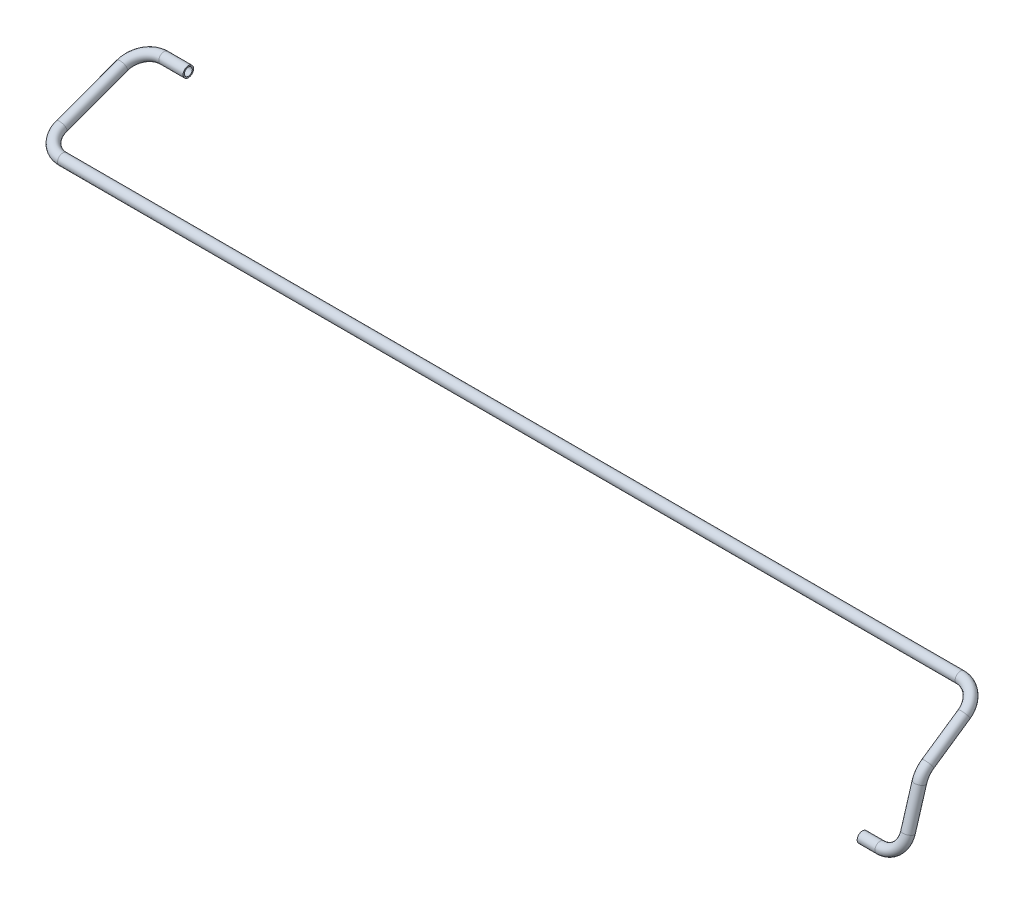
ISO-10303-21;
HEADER;
FILE_DESCRIPTION(('STEP AP214'),'2;1');
FILE_NAME('part.step','',(''),(''),'','','');
FILE_SCHEMA(('AUTOMOTIVE_DESIGN { 1 0 10303 214 1 1 1 1 }'));
ENDSEC;
DATA;
#1=APPLICATION_CONTEXT('core data for automotive mechanical design processes');
#2=APPLICATION_PROTOCOL_DEFINITION('international standard','automotive_design',2000,#1);
#3=PRODUCT_CONTEXT('',#1,'mechanical');
#4=PRODUCT('Part','Part','',(#3));
#5=PRODUCT_RELATED_PRODUCT_CATEGORY('part','',(#4));
#6=PRODUCT_DEFINITION_FORMATION('','',#4);
#7=PRODUCT_DEFINITION_CONTEXT('part definition',#1,'design');
#8=PRODUCT_DEFINITION('design','',#6,#7);
#9=PRODUCT_DEFINITION_SHAPE('','',#8);
#10=(LENGTH_UNIT() NAMED_UNIT(*) SI_UNIT(.MILLI.,.METRE.));
#11=(NAMED_UNIT(*) PLANE_ANGLE_UNIT() SI_UNIT($,.RADIAN.));
#12=(NAMED_UNIT(*) SI_UNIT($,.STERADIAN.) SOLID_ANGLE_UNIT());
#13=UNCERTAINTY_MEASURE_WITH_UNIT(LENGTH_MEASURE(1.E-05),#10,'distance_accuracy_value','');
#14=(GEOMETRIC_REPRESENTATION_CONTEXT(3) GLOBAL_UNCERTAINTY_ASSIGNED_CONTEXT((#13)) GLOBAL_UNIT_ASSIGNED_CONTEXT((#10,
#11,#12)) REPRESENTATION_CONTEXT('',''));
#15=CARTESIAN_POINT('',(0.,0.,0.));
#16=DIRECTION('',(0.,0.,1.));
#17=DIRECTION('',(1.,0.,0.));
#18=AXIS2_PLACEMENT_3D('',#15,#16,#17);
#19=CARTESIAN_POINT('',(-1338.5,219.5,-276.));
#20=DIRECTION('',(1.,0.,0.));
#21=DIRECTION('',(0.,0.,-1.));
#22=AXIS2_PLACEMENT_3D('',#19,#20,#21);
#23=CYLINDRICAL_SURFACE('',#22,8.);
#24=CARTESIAN_POINT('',(-1338.5,219.5,-276.));
#25=DIRECTION('',(1.,0.,0.));
#26=DIRECTION('',(0.,-0.923270244876087,-0.384151083463851));
#27=AXIS2_PLACEMENT_3D('',#24,#25,#26);
#28=CIRCLE('',#27,8.);
#29=CARTESIAN_POINT('',(-1338.5,222.255470131868,-283.510484961198));
#30=VERTEX_POINT('',#29);
#31=EDGE_CURVE('E55',#30,#30,#28,.T.);
#32=ORIENTED_EDGE('',*,*,#31,.T.);
#33=EDGE_LOOP('',(#32));
#34=FACE_BOUND('',#33,.T.);
#35=CARTESIAN_POINT('',(-1301.5,219.5,-276.));
#36=DIRECTION('',(1.,0.,0.));
#37=DIRECTION('',(0.,-0.923270244876087,-0.384151083463851));
#38=AXIS2_PLACEMENT_3D('',#35,#36,#37);
#39=CIRCLE('',#38,8.);
#40=CARTESIAN_POINT('',(-1301.5,212.113838040991,-279.073208667711));
#41=VERTEX_POINT('',#40);
#42=EDGE_CURVE('E10',#41,#41,#39,.T.);
#43=ORIENTED_EDGE('',*,*,#42,.F.);
#44=EDGE_LOOP('',(#43));
#45=FACE_BOUND('',#44,.T.);
#46=ADVANCED_FACE('F45',(#34,#45),#23,.T.);
#47=CARTESIAN_POINT('',(-1338.5,219.5,-276.));
#48=DIRECTION('',(1.,0.,0.));
#49=DIRECTION('',(0.,0.,-1.));
#50=AXIS2_PLACEMENT_3D('',#47,#48,#49);
#51=CYLINDRICAL_SURFACE('',#50,6.);
#52=CARTESIAN_POINT('',(-1338.5,219.5,-276.));
#53=DIRECTION('',(1.,0.,0.));
#54=DIRECTION('',(0.,-0.923270244876087,-0.384151083463851));
#55=AXIS2_PLACEMENT_3D('',#52,#53,#54);
#56=CIRCLE('',#55,6.);
#57=CARTESIAN_POINT('',(-1338.5,221.566602598901,-281.632863720898));
#58=VERTEX_POINT('',#57);
#59=EDGE_CURVE('E59',#58,#58,#56,.T.);
#60=ORIENTED_EDGE('',*,*,#59,.F.);
#61=EDGE_LOOP('',(#60));
#62=FACE_BOUND('',#61,.T.);
#63=CARTESIAN_POINT('',(-1301.5,219.5,-276.));
#64=DIRECTION('',(1.,0.,0.));
#65=DIRECTION('',(0.,-0.923270244876087,-0.384151083463851));
#66=AXIS2_PLACEMENT_3D('',#63,#64,#65);
#67=CIRCLE('',#66,6.);
#68=CARTESIAN_POINT('',(-1301.5,213.960378530744,-278.304906500783));
#69=VERTEX_POINT('',#68);
#70=EDGE_CURVE('E51',#69,#69,#67,.T.);
#71=ORIENTED_EDGE('',*,*,#70,.T.);
#72=EDGE_LOOP('',(#71));
#73=FACE_BOUND('',#72,.T.);
#74=ADVANCED_FACE('F145',(#62,#73),#51,.F.);
#75=CARTESIAN_POINT('',(-1338.5,208.133685706044,-245.019249535058));
#76=DIRECTION('',(0.,-0.93881062014976,-0.344433766483518));
#77=DIRECTION('',(0.,0.344433766483518,-0.938810620149761));
#78=AXIS2_PLACEMENT_3D('',#75,#76,#77);
#79=TOROIDAL_SURFACE('',#78,32.9999999999999,8.);
#80=CARTESIAN_POINT('',(-1371.5,208.133685706044,-245.019249535058));
#81=DIRECTION('',(0.,0.344433766483518,-0.93881062014976));
#82=DIRECTION('',(-0.0426396689730701,-0.937956786662092,-0.344120509392263));
#83=AXIS2_PLACEMENT_3D('',#80,#81,#82);
#84=CIRCLE('',#83,8.);
#85=CARTESIAN_POINT('',(-1379.5,208.133685706044,-245.019249535058));
#86=VERTEX_POINT('',#85);
#87=EDGE_CURVE('E64',#86,#86,#84,.T.);
#88=CARTESIAN_POINT('',(-1338.5,208.133685706044,-245.019249535058));
#89=DIRECTION('',(0.,-0.93881062014976,-0.344433766483518));
#90=DIRECTION('',(0.,0.344433766483518,-0.938810620149761));
#91=AXIS2_PLACEMENT_3D('',#88,#89,#90);
#92=CIRCLE('',#91,40.9999999999999);
#93=EDGE_CURVE('',#86,#30,#92,.T.);
#94=ORIENTED_EDGE('',*,*,#87,.T.);
#95=ORIENTED_EDGE('',*,*,#31,.F.);
#96=ORIENTED_EDGE('',*,*,#93,.T.);
#97=ORIENTED_EDGE('',*,*,#93,.F.);
#98=EDGE_LOOP('',(#94,#96,#95,#97));
#99=FACE_BOUND('',#98,.T.);
#100=ADVANCED_FACE('F150',(#99),#79,.T.);
#101=CARTESIAN_POINT('',(-1338.5,208.133685706044,-245.019249535058));
#102=DIRECTION('',(0.,-0.93881062014976,-0.344433766483518));
#103=DIRECTION('',(0.,0.344433766483518,-0.938810620149761));
#104=AXIS2_PLACEMENT_3D('',#101,#102,#103);
#105=TOROIDAL_SURFACE('',#104,32.9999999999999,6.);
#106=CARTESIAN_POINT('',(-1371.5,208.133685706044,-245.019249535058));
#107=DIRECTION('',(0.,0.344433766483518,-0.93881062014976));
#108=DIRECTION('',(-0.0426396689730701,-0.937956786662092,-0.344120509392263));
#109=AXIS2_PLACEMENT_3D('',#106,#107,#108);
#110=CIRCLE('',#109,6.);
#111=CARTESIAN_POINT('',(-1377.5,208.133685706044,-245.019249535058));
#112=VERTEX_POINT('',#111);
#113=EDGE_CURVE('E67',#112,#112,#110,.T.);
#114=CARTESIAN_POINT('',(-1338.5,208.133685706044,-245.019249535058));
#115=DIRECTION('',(0.,-0.93881062014976,-0.344433766483518));
#116=DIRECTION('',(0.,0.344433766483518,-0.938810620149761));
#117=AXIS2_PLACEMENT_3D('',#114,#115,#116);
#118=CIRCLE('',#117,38.9999999999999);
#119=EDGE_CURVE('',#112,#58,#118,.T.);
#120=ORIENTED_EDGE('',*,*,#113,.F.);
#121=ORIENTED_EDGE('',*,*,#59,.T.);
#122=ORIENTED_EDGE('',*,*,#119,.T.);
#123=ORIENTED_EDGE('',*,*,#119,.F.);
#124=EDGE_LOOP('',(#120,#122,#121,#123));
#125=FACE_BOUND('',#124,.T.);
#126=ADVANCED_FACE('F156',(#125),#105,.F.);
#127=CARTESIAN_POINT('',(-1371.5,174.366314293956,-152.980750464942));
#128=DIRECTION('',(0.,0.344433766483516,-0.938810620149761));
#129=DIRECTION('',(0.,0.938810620149761,0.344433766483516));
#130=AXIS2_PLACEMENT_3D('',#127,#128,#129);
#131=CYLINDRICAL_SURFACE('',#130,8.);
#132=CARTESIAN_POINT('',(-1371.5,174.366314293956,-152.980750464942));
#133=DIRECTION('',(0.,0.344433766483518,-0.93881062014976));
#134=DIRECTION('',(-0.0426396689730701,-0.937956786662092,-0.344120509392263));
#135=AXIS2_PLACEMENT_3D('',#132,#133,#134);
#136=CIRCLE('',#135,8.);
#137=CARTESIAN_POINT('',(-1379.5,174.366314293956,-152.980750464942));
#138=VERTEX_POINT('',#137);
#139=EDGE_CURVE('E70',#138,#138,#136,.T.);
#140=ORIENTED_EDGE('',*,*,#139,.T.);
#141=EDGE_LOOP('',(#140));
#142=FACE_BOUND('',#141,.T.);
#143=ORIENTED_EDGE('',*,*,#87,.F.);
#144=EDGE_LOOP('',(#143));
#145=FACE_BOUND('',#144,.T.);
#146=ADVANCED_FACE('F162',(#142,#145),#131,.T.);
#147=CARTESIAN_POINT('',(-1371.5,174.366314293956,-152.980750464942));
#148=DIRECTION('',(0.,0.344433766483516,-0.938810620149761));
#149=DIRECTION('',(0.,0.938810620149761,0.344433766483516));
#150=AXIS2_PLACEMENT_3D('',#147,#148,#149);
#151=CYLINDRICAL_SURFACE('',#150,6.);
#152=CARTESIAN_POINT('',(-1371.5,174.366314293956,-152.980750464942));
#153=DIRECTION('',(0.,0.344433766483518,-0.93881062014976));
#154=DIRECTION('',(-0.0426396689730701,-0.937956786662092,-0.344120509392263));
#155=AXIS2_PLACEMENT_3D('',#152,#153,#154);
#156=CIRCLE('',#155,6.);
#157=CARTESIAN_POINT('',(-1377.5,174.366314293956,-152.980750464942));
#158=VERTEX_POINT('',#157);
#159=EDGE_CURVE('E73',#158,#158,#156,.T.);
#160=ORIENTED_EDGE('',*,*,#159,.F.);
#161=EDGE_LOOP('',(#160));
#162=FACE_BOUND('',#161,.T.);
#163=ORIENTED_EDGE('',*,*,#113,.T.);
#164=EDGE_LOOP('',(#163));
#165=FACE_BOUND('',#164,.T.);
#166=ADVANCED_FACE('F168',(#162,#165),#151,.F.);
#167=CARTESIAN_POINT('',(-1338.5,174.366314293956,-152.980750464942));
#168=DIRECTION('',(0.,-0.938810620149761,-0.344433766483516));
#169=DIRECTION('',(0.,0.344433766483516,-0.938810620149761));
#170=AXIS2_PLACEMENT_3D('',#167,#168,#169);
#171=TOROIDAL_SURFACE('',#170,33.,8.);
#172=CARTESIAN_POINT('',(-1338.5,163.,-122.));
#173=DIRECTION('',(-1.,0.,0.));
#174=DIRECTION('',(0.,-0.952643328448097,-0.304089935320673));
#175=AXIS2_PLACEMENT_3D('',#172,#173,#174);
#176=CIRCLE('',#175,8.);
#177=CARTESIAN_POINT('',(-1338.5,160.244529868132,-114.489515038802));
#178=VERTEX_POINT('',#177);
#179=EDGE_CURVE('E76',#178,#178,#176,.T.);
#180=CARTESIAN_POINT('',(-1338.5,174.366314293956,-152.980750464942));
#181=DIRECTION('',(0.,-0.938810620149761,-0.344433766483516));
#182=DIRECTION('',(0.,0.344433766483516,-0.938810620149761));
#183=AXIS2_PLACEMENT_3D('',#180,#181,#182);
#184=CIRCLE('',#183,41.);
#185=EDGE_CURVE('',#178,#138,#184,.T.);
#186=ORIENTED_EDGE('',*,*,#179,.T.);
#187=ORIENTED_EDGE('',*,*,#139,.F.);
#188=ORIENTED_EDGE('',*,*,#185,.T.);
#189=ORIENTED_EDGE('',*,*,#185,.F.);
#190=EDGE_LOOP('',(#186,#188,#187,#189));
#191=FACE_BOUND('',#190,.T.);
#192=ADVANCED_FACE('F172',(#191),#171,.T.);
#193=CARTESIAN_POINT('',(-1338.5,174.366314293956,-152.980750464942));
#194=DIRECTION('',(0.,-0.938810620149761,-0.344433766483516));
#195=DIRECTION('',(0.,0.344433766483516,-0.938810620149761));
#196=AXIS2_PLACEMENT_3D('',#193,#194,#195);
#197=TOROIDAL_SURFACE('',#196,33.,6.);
#198=CARTESIAN_POINT('',(-1338.5,163.,-122.));
#199=DIRECTION('',(-1.,0.,0.));
#200=DIRECTION('',(0.,-0.952643328448097,-0.304089935320673));
#201=AXIS2_PLACEMENT_3D('',#198,#199,#200);
#202=CIRCLE('',#201,6.);
#203=CARTESIAN_POINT('',(-1338.5,160.933397401099,-116.367136279101));
#204=VERTEX_POINT('',#203);
#205=EDGE_CURVE('E79',#204,#204,#202,.T.);
#206=CARTESIAN_POINT('',(-1338.5,174.366314293956,-152.980750464942));
#207=DIRECTION('',(0.,-0.938810620149761,-0.344433766483516));
#208=DIRECTION('',(0.,0.344433766483516,-0.938810620149761));
#209=AXIS2_PLACEMENT_3D('',#206,#207,#208);
#210=CIRCLE('',#209,39.);
#211=EDGE_CURVE('',#204,#158,#210,.T.);
#212=ORIENTED_EDGE('',*,*,#205,.F.);
#213=ORIENTED_EDGE('',*,*,#159,.T.);
#214=ORIENTED_EDGE('',*,*,#211,.T.);
#215=ORIENTED_EDGE('',*,*,#211,.F.);
#216=EDGE_LOOP('',(#212,#214,#213,#215));
#217=FACE_BOUND('',#216,.T.);
#218=ADVANCED_FACE('F176',(#217),#197,.F.);
#219=CARTESIAN_POINT('',(27.,163.,-122.));
#220=DIRECTION('',(-1.,0.,0.));
#221=DIRECTION('',(0.,-1.,0.));
#222=AXIS2_PLACEMENT_3D('',#219,#220,#221);
#223=CYLINDRICAL_SURFACE('',#222,8.);
#224=CARTESIAN_POINT('',(27.,163.,-122.));
#225=DIRECTION('',(-1.,0.,0.));
#226=DIRECTION('',(0.,-0.952643328448097,-0.304089935320673));
#227=AXIS2_PLACEMENT_3D('',#224,#225,#226);
#228=CIRCLE('',#227,8.);
#229=CARTESIAN_POINT('',(27.,167.520043033998,-128.600697763934));
#230=VERTEX_POINT('',#229);
#231=EDGE_CURVE('E82',#230,#230,#228,.T.);
#232=ORIENTED_EDGE('',*,*,#231,.T.);
#233=EDGE_LOOP('',(#232));
#234=FACE_BOUND('',#233,.T.);
#235=ORIENTED_EDGE('',*,*,#179,.F.);
#236=EDGE_LOOP('',(#235));
#237=FACE_BOUND('',#236,.T.);
#238=ADVANCED_FACE('F180',(#234,#237),#223,.T.);
#239=CARTESIAN_POINT('',(27.,163.,-122.));
#240=DIRECTION('',(-1.,0.,0.));
#241=DIRECTION('',(0.,-1.,0.));
#242=AXIS2_PLACEMENT_3D('',#239,#240,#241);
#243=CYLINDRICAL_SURFACE('',#242,6.);
#244=CARTESIAN_POINT('',(27.,163.,-122.));
#245=DIRECTION('',(-1.,0.,0.));
#246=DIRECTION('',(0.,-0.952643328448097,-0.304089935320673));
#247=AXIS2_PLACEMENT_3D('',#244,#245,#246);
#248=CIRCLE('',#247,6.);
#249=CARTESIAN_POINT('',(27.,166.390032275499,-126.95052332295));
#250=VERTEX_POINT('',#249);
#251=EDGE_CURVE('E85',#250,#250,#248,.T.);
#252=ORIENTED_EDGE('',*,*,#251,.F.);
#253=EDGE_LOOP('',(#252));
#254=FACE_BOUND('',#253,.T.);
#255=ORIENTED_EDGE('',*,*,#205,.T.);
#256=EDGE_LOOP('',(#255));
#257=FACE_BOUND('',#256,.T.);
#258=ADVANCED_FACE('F184',(#254,#257),#243,.F.);
#259=CARTESIAN_POINT('',(27.,144.354822484757,-94.7721217237722));
#260=DIRECTION('',(0.,0.825087220491752,0.565005379249786));
#261=DIRECTION('',(0.,-0.565005379249786,0.825087220491752));
#262=AXIS2_PLACEMENT_3D('',#259,#260,#261);
#263=TOROIDAL_SURFACE('',#262,33.,8.);
#264=CARTESIAN_POINT('',(60.,144.354822484757,-94.7721217237722));
#265=DIRECTION('',(0.,0.565005379249788,-0.825087220491751));
#266=DIRECTION('',(-0.287347885566345,-0.790290227387059,-0.541177003536792));
#267=AXIS2_PLACEMENT_3D('',#264,#265,#266);
#268=CIRCLE('',#267,8.);
#269=CARTESIAN_POINT('',(68.,144.354822484757,-94.7721217237722));
#270=VERTEX_POINT('',#269);
#271=EDGE_CURVE('E88',#270,#270,#268,.T.);
#272=CARTESIAN_POINT('',(27.,144.354822484757,-94.7721217237722));
#273=DIRECTION('',(0.,0.825087220491752,0.565005379249786));
#274=DIRECTION('',(0.,-0.565005379249786,0.825087220491752));
#275=AXIS2_PLACEMENT_3D('',#272,#273,#274);
#276=CIRCLE('',#275,41.);
#277=EDGE_CURVE('',#270,#230,#276,.T.);
#278=ORIENTED_EDGE('',*,*,#271,.T.);
#279=ORIENTED_EDGE('',*,*,#231,.F.);
#280=ORIENTED_EDGE('',*,*,#277,.T.);
#281=ORIENTED_EDGE('',*,*,#277,.F.);
#282=EDGE_LOOP('',(#278,#280,#279,#281));
#283=FACE_BOUND('',#282,.T.);
#284=ADVANCED_FACE('F188',(#283),#263,.T.);
#285=CARTESIAN_POINT('',(27.,144.354822484757,-94.7721217237722));
#286=DIRECTION('',(0.,0.825087220491752,0.565005379249786));
#287=DIRECTION('',(0.,-0.565005379249786,0.825087220491752));
#288=AXIS2_PLACEMENT_3D('',#285,#286,#287);
#289=TOROIDAL_SURFACE('',#288,33.,6.);
#290=CARTESIAN_POINT('',(60.,144.354822484757,-94.7721217237722));
#291=DIRECTION('',(0.,0.565005379249788,-0.825087220491751));
#292=DIRECTION('',(-0.287347885566345,-0.790290227387059,-0.541177003536792));
#293=AXIS2_PLACEMENT_3D('',#290,#291,#292);
#294=CIRCLE('',#293,6.);
#295=CARTESIAN_POINT('',(66.,144.354822484757,-94.7721217237722));
#296=VERTEX_POINT('',#295);
#297=EDGE_CURVE('E91',#296,#296,#294,.T.);
#298=CARTESIAN_POINT('',(27.,144.354822484757,-94.7721217237722));
#299=DIRECTION('',(0.,0.825087220491752,0.565005379249786));
#300=DIRECTION('',(0.,-0.565005379249786,0.825087220491752));
#301=AXIS2_PLACEMENT_3D('',#298,#299,#300);
#302=CIRCLE('',#301,39.);
#303=EDGE_CURVE('',#296,#250,#302,.T.);
#304=ORIENTED_EDGE('',*,*,#297,.F.);
#305=ORIENTED_EDGE('',*,*,#251,.T.);
#306=ORIENTED_EDGE('',*,*,#303,.T.);
#307=ORIENTED_EDGE('',*,*,#303,.F.);
#308=EDGE_LOOP('',(#304,#306,#305,#307));
#309=FACE_BOUND('',#308,.T.);
#310=ADVANCED_FACE('F192',(#309),#289,.F.);
#311=CARTESIAN_POINT('',(60.,106.58394856801,-39.6146550516965));
#312=DIRECTION('',(0.,0.565005379249787,-0.825087220491752));
#313=DIRECTION('',(0.,0.825087220491752,0.565005379249787));
#314=AXIS2_PLACEMENT_3D('',#311,#312,#313);
#315=CYLINDRICAL_SURFACE('',#314,8.);
#316=CARTESIAN_POINT('',(60.,106.58394856801,-39.6146550516965));
#317=DIRECTION('',(0.,0.565005379249788,-0.825087220491751));
#318=DIRECTION('',(-0.287347885566345,-0.790290227387059,-0.541177003536792));
#319=AXIS2_PLACEMENT_3D('',#316,#317,#318);
#320=CIRCLE('',#319,8.);
#321=CARTESIAN_POINT('',(60.,113.184646331944,-35.0946120176982));
#322=VERTEX_POINT('',#321);
#323=EDGE_CURVE('E94',#322,#322,#320,.T.);
#324=ORIENTED_EDGE('',*,*,#323,.T.);
#325=EDGE_LOOP('',(#324));
#326=FACE_BOUND('',#325,.T.);
#327=ORIENTED_EDGE('',*,*,#271,.F.);
#328=EDGE_LOOP('',(#327));
#329=FACE_BOUND('',#328,.T.);
#330=ADVANCED_FACE('F196',(#326,#329),#315,.T.);
#331=CARTESIAN_POINT('',(60.,106.58394856801,-39.6146550516965));
#332=DIRECTION('',(0.,0.565005379249787,-0.825087220491752));
#333=DIRECTION('',(0.,0.825087220491752,0.565005379249787));
#334=AXIS2_PLACEMENT_3D('',#331,#332,#333);
#335=CYLINDRICAL_SURFACE('',#334,6.);
#336=CARTESIAN_POINT('',(60.,106.58394856801,-39.6146550516965));
#337=DIRECTION('',(0.,0.565005379249788,-0.825087220491751));
#338=DIRECTION('',(-0.287347885566345,-0.790290227387059,-0.541177003536792));
#339=AXIS2_PLACEMENT_3D('',#336,#337,#338);
#340=CIRCLE('',#339,6.);
#341=CARTESIAN_POINT('',(60.,111.53447189096,-36.2246227761977));
#342=VERTEX_POINT('',#341);
#343=EDGE_CURVE('E97',#342,#342,#340,.T.);
#344=ORIENTED_EDGE('',*,*,#343,.F.);
#345=EDGE_LOOP('',(#344));
#346=FACE_BOUND('',#345,.T.);
#347=ORIENTED_EDGE('',*,*,#297,.T.);
#348=EDGE_LOOP('',(#347));
#349=FACE_BOUND('',#348,.T.);
#350=ADVANCED_FACE('F200',(#346,#349),#335,.F.);
#351=CARTESIAN_POINT('',(60.,79.3560702917817,-58.2598325669394));
#352=DIRECTION('',(-1.,0.,0.));
#353=DIRECTION('',(0.,0.,1.));
#354=AXIS2_PLACEMENT_3D('',#351,#352,#353);
#355=TOROIDAL_SURFACE('',#354,33.,8.);
#356=CARTESIAN_POINT('',(60.,88.8385505154712,-26.6515651546415));
#357=DIRECTION('',(0.,0.957826285221151,-0.287347885566345));
#358=DIRECTION('',(-0.287347885566345,-0.275229357798165,-0.91743119266055));
#359=AXIS2_PLACEMENT_3D('',#356,#357,#358);
#360=CIRCLE('',#359,8.);
#361=CARTESIAN_POINT('',(60.,91.1373336000019,-18.9889548728722));
#362=VERTEX_POINT('',#361);
#363=EDGE_CURVE('E100',#362,#362,#360,.T.);
#364=CARTESIAN_POINT('',(60.,79.3560702917817,-58.2598325669394));
#365=DIRECTION('',(-1.,0.,0.));
#366=DIRECTION('',(0.,0.,1.));
#367=AXIS2_PLACEMENT_3D('',#364,#365,#366);
#368=CIRCLE('',#367,41.);
#369=EDGE_CURVE('',#362,#322,#368,.T.);
#370=ORIENTED_EDGE('',*,*,#363,.T.);
#371=ORIENTED_EDGE('',*,*,#323,.F.);
#372=ORIENTED_EDGE('',*,*,#369,.T.);
#373=ORIENTED_EDGE('',*,*,#369,.F.);
#374=EDGE_LOOP('',(#370,#372,#371,#373));
#375=FACE_BOUND('',#374,.T.);
#376=ADVANCED_FACE('F204',(#375),#355,.T.);
#377=CARTESIAN_POINT('',(60.,79.3560702917817,-58.2598325669394));
#378=DIRECTION('',(-1.,0.,0.));
#379=DIRECTION('',(0.,0.,1.));
#380=AXIS2_PLACEMENT_3D('',#377,#378,#379);
#381=TOROIDAL_SURFACE('',#380,33.,6.);
#382=CARTESIAN_POINT('',(60.,88.8385505154712,-26.6515651546415));
#383=DIRECTION('',(0.,0.957826285221151,-0.287347885566345));
#384=DIRECTION('',(-0.287347885566345,-0.275229357798165,-0.91743119266055));
#385=AXIS2_PLACEMENT_3D('',#382,#383,#384);
#386=CIRCLE('',#385,6.);
#387=CARTESIAN_POINT('',(60.,90.5626378288692,-20.9046074433145));
#388=VERTEX_POINT('',#387);
#389=EDGE_CURVE('E103',#388,#388,#386,.T.);
#390=CARTESIAN_POINT('',(60.,79.3560702917817,-58.2598325669394));
#391=DIRECTION('',(-1.,0.,0.));
#392=DIRECTION('',(0.,0.,1.));
#393=AXIS2_PLACEMENT_3D('',#390,#391,#392);
#394=CIRCLE('',#393,39.);
#395=EDGE_CURVE('',#388,#342,#394,.T.);
#396=ORIENTED_EDGE('',*,*,#389,.F.);
#397=ORIENTED_EDGE('',*,*,#343,.T.);
#398=ORIENTED_EDGE('',*,*,#395,.T.);
#399=ORIENTED_EDGE('',*,*,#395,.F.);
#400=EDGE_LOOP('',(#396,#398,#397,#399));
#401=FACE_BOUND('',#400,.T.);
#402=ADVANCED_FACE('F208',(#401),#381,.F.);
#403=CARTESIAN_POINT('',(60.,31.608267412298,-9.4824802236894));
#404=DIRECTION('',(0.,0.957826285221151,-0.287347885566347));
#405=DIRECTION('',(0.,0.287347885566347,0.957826285221151));
#406=AXIS2_PLACEMENT_3D('',#403,#404,#405);
#407=CYLINDRICAL_SURFACE('',#406,8.);
#408=CARTESIAN_POINT('',(60.,31.608267412298,-9.4824802236894));
#409=DIRECTION('',(0.,0.957826285221151,-0.287347885566345));
#410=DIRECTION('',(-0.287347885566345,-0.275229357798165,-0.91743119266055));
#411=AXIS2_PLACEMENT_3D('',#408,#409,#410);
#412=CIRCLE('',#411,8.);
#413=CARTESIAN_POINT('',(68.,31.608267412298,-9.4824802236894));
#414=VERTEX_POINT('',#413);
#415=EDGE_CURVE('E106',#414,#414,#412,.T.);
#416=ORIENTED_EDGE('',*,*,#415,.T.);
#417=EDGE_LOOP('',(#416));
#418=FACE_BOUND('',#417,.T.);
#419=ORIENTED_EDGE('',*,*,#363,.F.);
#420=EDGE_LOOP('',(#419));
#421=FACE_BOUND('',#420,.T.);
#422=ADVANCED_FACE('F212',(#418,#421),#407,.T.);
#423=CARTESIAN_POINT('',(60.,31.608267412298,-9.4824802236894));
#424=DIRECTION('',(0.,0.957826285221151,-0.287347885566347));
#425=DIRECTION('',(0.,0.287347885566347,0.957826285221151));
#426=AXIS2_PLACEMENT_3D('',#423,#424,#425);
#427=CYLINDRICAL_SURFACE('',#426,6.);
#428=CARTESIAN_POINT('',(60.,31.608267412298,-9.4824802236894));
#429=DIRECTION('',(0.,0.957826285221151,-0.287347885566345));
#430=DIRECTION('',(-0.287347885566345,-0.275229357798165,-0.91743119266055));
#431=AXIS2_PLACEMENT_3D('',#428,#429,#430);
#432=CIRCLE('',#431,6.);
#433=CARTESIAN_POINT('',(66.,31.608267412298,-9.4824802236894));
#434=VERTEX_POINT('',#433);
#435=EDGE_CURVE('E109',#434,#434,#432,.T.);
#436=ORIENTED_EDGE('',*,*,#435,.F.);
#437=EDGE_LOOP('',(#436));
#438=FACE_BOUND('',#437,.T.);
#439=ORIENTED_EDGE('',*,*,#389,.T.);
#440=EDGE_LOOP('',(#439));
#441=FACE_BOUND('',#440,.T.);
#442=ADVANCED_FACE('F216',(#438,#441),#427,.F.);
#443=CARTESIAN_POINT('',(27.,31.608267412298,-9.4824802236894));
#444=DIRECTION('',(0.,0.287347885566345,0.957826285221151));
#445=DIRECTION('',(0.,-0.957826285221152,0.287347885566346));
#446=AXIS2_PLACEMENT_3D('',#443,#444,#445);
#447=TOROIDAL_SURFACE('',#446,33.,8.);
#448=CARTESIAN_POINT('',(27.,0.,0.));
#449=DIRECTION('',(1.,0.,0.));
#450=DIRECTION('',(0.,0.,-1.));
#451=AXIS2_PLACEMENT_3D('',#448,#449,#450);
#452=CIRCLE('',#451,8.);
#453=CARTESIAN_POINT('',(27.,-7.66261028176921,2.29878308453076));
#454=VERTEX_POINT('',#453);
#455=EDGE_CURVE('E112',#454,#454,#452,.T.);
#456=CARTESIAN_POINT('',(27.,31.608267412298,-9.4824802236894));
#457=DIRECTION('',(0.,0.287347885566345,0.957826285221151));
#458=DIRECTION('',(0.,-0.957826285221152,0.287347885566346));
#459=AXIS2_PLACEMENT_3D('',#456,#457,#458);
#460=CIRCLE('',#459,41.);
#461=EDGE_CURVE('',#454,#414,#460,.T.);
#462=ORIENTED_EDGE('',*,*,#455,.T.);
#463=ORIENTED_EDGE('',*,*,#415,.F.);
#464=ORIENTED_EDGE('',*,*,#461,.T.);
#465=ORIENTED_EDGE('',*,*,#461,.F.);
#466=EDGE_LOOP('',(#462,#464,#463,#465));
#467=FACE_BOUND('',#466,.T.);
#468=ADVANCED_FACE('F141',(#467),#447,.T.);
#469=CARTESIAN_POINT('',(27.,31.608267412298,-9.4824802236894));
#470=DIRECTION('',(0.,0.287347885566345,0.957826285221151));
#471=DIRECTION('',(0.,-0.957826285221152,0.287347885566346));
#472=AXIS2_PLACEMENT_3D('',#469,#470,#471);
#473=TOROIDAL_SURFACE('',#472,33.,6.);
#474=CARTESIAN_POINT('',(27.,0.,0.));
#475=DIRECTION('',(1.,0.,0.));
#476=DIRECTION('',(0.,0.,-1.));
#477=AXIS2_PLACEMENT_3D('',#474,#475,#476);
#478=CIRCLE('',#477,6.);
#479=CARTESIAN_POINT('',(27.,-5.7469577113269,1.72408731339807));
#480=VERTEX_POINT('',#479);
#481=EDGE_CURVE('E115',#480,#480,#478,.T.);
#482=CARTESIAN_POINT('',(27.,31.608267412298,-9.4824802236894));
#483=DIRECTION('',(0.,0.287347885566345,0.957826285221151));
#484=DIRECTION('',(0.,-0.957826285221152,0.287347885566346));
#485=AXIS2_PLACEMENT_3D('',#482,#483,#484);
#486=CIRCLE('',#485,39.);
#487=EDGE_CURVE('',#480,#434,#486,.T.);
#488=ORIENTED_EDGE('',*,*,#481,.F.);
#489=ORIENTED_EDGE('',*,*,#435,.T.);
#490=ORIENTED_EDGE('',*,*,#487,.T.);
#491=ORIENTED_EDGE('',*,*,#487,.F.);
#492=EDGE_LOOP('',(#488,#490,#489,#491));
#493=FACE_BOUND('',#492,.T.);
#494=ADVANCED_FACE('F131',(#493),#473,.F.);
#495=CARTESIAN_POINT('',(27.,0.,0.));
#496=DIRECTION('',(-1.,0.,0.));
#497=DIRECTION('',(0.,0.,1.));
#498=AXIS2_PLACEMENT_3D('',#495,#496,#497);
#499=CYLINDRICAL_SURFACE('',#498,6.);
#500=ORIENTED_EDGE('',*,*,#481,.T.);
#501=EDGE_LOOP('',(#500));
#502=FACE_BOUND('',#501,.T.);
#503=CARTESIAN_POINT('',(0.,0.,0.));
#504=DIRECTION('',(1.,0.,0.));
#505=DIRECTION('',(0.,0.,-1.));
#506=AXIS2_PLACEMENT_3D('',#503,#504,#505);
#507=CIRCLE('',#506,6.);
#508=CARTESIAN_POINT('',(0.,0.,-6.));
#509=VERTEX_POINT('',#508);
#510=EDGE_CURVE('E121',#509,#509,#507,.T.);
#511=ORIENTED_EDGE('',*,*,#510,.F.);
#512=EDGE_LOOP('',(#511));
#513=FACE_BOUND('',#512,.T.);
#514=ADVANCED_FACE('F128',(#502,#513),#499,.F.);
#515=CARTESIAN_POINT('',(27.,0.,0.));
#516=DIRECTION('',(-1.,0.,0.));
#517=DIRECTION('',(0.,0.,1.));
#518=AXIS2_PLACEMENT_3D('',#515,#516,#517);
#519=CYLINDRICAL_SURFACE('',#518,8.);
#520=ORIENTED_EDGE('',*,*,#455,.F.);
#521=EDGE_LOOP('',(#520));
#522=FACE_BOUND('',#521,.T.);
#523=CARTESIAN_POINT('',(0.,0.,0.));
#524=DIRECTION('',(1.,0.,0.));
#525=DIRECTION('',(0.,0.,-1.));
#526=AXIS2_PLACEMENT_3D('',#523,#524,#525);
#527=CIRCLE('',#526,8.);
#528=CARTESIAN_POINT('',(0.,0.,-8.));
#529=VERTEX_POINT('',#528);
#530=EDGE_CURVE('E118',#529,#529,#527,.T.);
#531=ORIENTED_EDGE('',*,*,#530,.T.);
#532=EDGE_LOOP('',(#531));
#533=FACE_BOUND('',#532,.T.);
#534=ADVANCED_FACE('F130',(#522,#533),#519,.T.);
#535=CARTESIAN_POINT('',(-1301.5,219.5,-276.));
#536=DIRECTION('',(1.,0.,0.));
#537=DIRECTION('',(0.,-0.923270244876088,-0.384151083463851));
#538=AXIS2_PLACEMENT_3D('',#535,#536,#537);
#539=PLANE('',#538);
#540=ORIENTED_EDGE('',*,*,#70,.F.);
#541=EDGE_LOOP('',(#540));
#542=FACE_BOUND('',#541,.T.);
#543=ORIENTED_EDGE('',*,*,#42,.T.);
#544=EDGE_LOOP('',(#543));
#545=FACE_BOUND('',#544,.T.);
#546=ADVANCED_FACE('F138',(#542,#545),#539,.T.);
#547=CARTESIAN_POINT('',(0.,0.,0.));
#548=DIRECTION('',(1.,0.,0.));
#549=DIRECTION('',(0.,0.,-1.));
#550=AXIS2_PLACEMENT_3D('',#547,#548,#549);
#551=PLANE('',#550);
#552=ORIENTED_EDGE('',*,*,#510,.T.);
#553=EDGE_LOOP('',(#552));
#554=FACE_BOUND('',#553,.T.);
#555=ORIENTED_EDGE('',*,*,#530,.F.);
#556=EDGE_LOOP('',(#555));
#557=FACE_BOUND('',#556,.T.);
#558=ADVANCED_FACE('F125',(#554,#557),#551,.F.);
#559=CLOSED_SHELL('',(#46,#74,#100,#126,#146,#166,#192,#218,#238,#258,#284,#310,#330,#350,#376,
#402,#422,#442,#468,#494,#514,#534,#546,#558));
#560=MANIFOLD_SOLID_BREP('B2',#559);
#561=ADVANCED_BREP_SHAPE_REPRESENTATION('',(#18,#560),#14);
#562=SHAPE_DEFINITION_REPRESENTATION(#9,#561);
ENDSEC;
END-ISO-10303-21;
